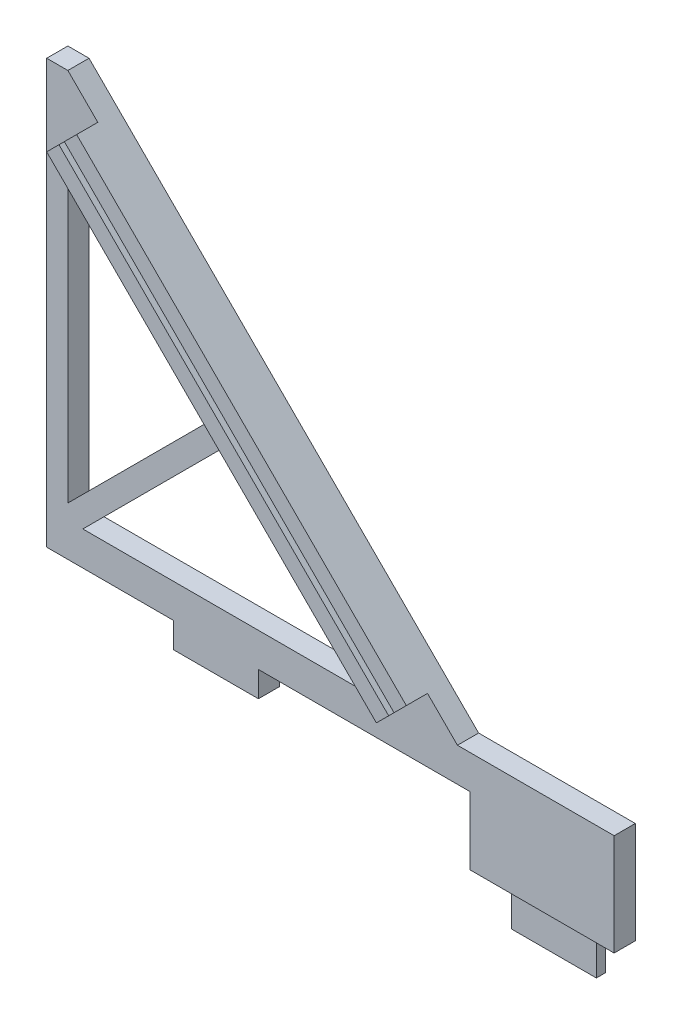
ISO-10303-21;
HEADER;
FILE_DESCRIPTION(('STEP AP214'),'2;1');
FILE_NAME('part.step','',(''),(''),'','','');
FILE_SCHEMA(('AUTOMOTIVE_DESIGN { 1 0 10303 214 1 1 1 1 }'));
ENDSEC;
DATA;
#1=APPLICATION_CONTEXT('core data for automotive mechanical design processes');
#2=APPLICATION_PROTOCOL_DEFINITION('international standard','automotive_design',2000,#1);
#3=PRODUCT_CONTEXT('',#1,'mechanical');
#4=PRODUCT('Part','Part','',(#3));
#5=PRODUCT_RELATED_PRODUCT_CATEGORY('part','',(#4));
#6=PRODUCT_DEFINITION_FORMATION('','',#4);
#7=PRODUCT_DEFINITION_CONTEXT('part definition',#1,'design');
#8=PRODUCT_DEFINITION('design','',#6,#7);
#9=PRODUCT_DEFINITION_SHAPE('','',#8);
#10=(LENGTH_UNIT() NAMED_UNIT(*) SI_UNIT(.MILLI.,.METRE.));
#11=(NAMED_UNIT(*) PLANE_ANGLE_UNIT() SI_UNIT($,.RADIAN.));
#12=(NAMED_UNIT(*) SI_UNIT($,.STERADIAN.) SOLID_ANGLE_UNIT());
#13=UNCERTAINTY_MEASURE_WITH_UNIT(LENGTH_MEASURE(1.E-05),#10,'distance_accuracy_value','');
#14=(GEOMETRIC_REPRESENTATION_CONTEXT(3) GLOBAL_UNCERTAINTY_ASSIGNED_CONTEXT((#13)) GLOBAL_UNIT_ASSIGNED_CONTEXT((#10,
#11,#12)) REPRESENTATION_CONTEXT('',''));
#15=CARTESIAN_POINT('',(0.,0.,0.));
#16=DIRECTION('',(0.,0.,1.));
#17=DIRECTION('',(1.,0.,0.));
#18=AXIS2_PLACEMENT_3D('',#15,#16,#17);
#19=CARTESIAN_POINT('',(0.,0.,3.175));
#20=DIRECTION('',(0.,0.,1.));
#21=DIRECTION('',(1.,0.,0.));
#22=AXIS2_PLACEMENT_3D('',#19,#20,#21);
#23=PLANE('',#22);
#24=DIRECTION('',(0.707106781186551,-0.707106781186544,0.));
#25=VECTOR('',#24,1.);
#26=CARTESIAN_POINT('',(-15.3302561210692,21.59,3.175));
#27=LINE('',#26,#25);
#28=CARTESIAN_POINT('',(-41.1726600756682,47.4324039545988,3.175));
#29=VERTEX_POINT('',#28);
#30=CARTESIAN_POINT('',(-38.9275960454009,45.1873399243315,3.175));
#31=VERTEX_POINT('',#30);
#32=EDGE_CURVE('E11',#29,#31,#27,.T.);
#33=ORIENTED_EDGE('',*,*,#32,.F.);
#34=DIRECTION('',(0.707106781186544,0.707106781186551,0.));
#35=VECTOR('',#34,1.);
#36=CARTESIAN_POINT('',(-41.1726600756682,47.4324039545988,3.175));
#37=LINE('',#36,#35);
#38=CARTESIAN_POINT('',(-64.77,23.8350640302668,3.175));
#39=VERTEX_POINT('',#38);
#40=EDGE_CURVE('E318',#39,#29,#37,.T.);
#41=ORIENTED_EDGE('',*,*,#40,.F.);
#42=DIRECTION('',(0.,-1.,0.));
#43=VECTOR('',#42,1.);
#44=CARTESIAN_POINT('',(-64.77,71.0297438789303,3.175));
#45=LINE('',#44,#43);
#46=CARTESIAN_POINT('',(-64.77,71.0297438789303,3.175));
#47=VERTEX_POINT('',#46);
#48=EDGE_CURVE('E315',#47,#39,#45,.T.);
#49=ORIENTED_EDGE('',*,*,#48,.F.);
#50=DIRECTION('',(-0.707106781186547,-0.707106781186547,0.));
#51=VECTOR('',#50,1.);
#52=CARTESIAN_POINT('',(-64.77,71.0297438789303,3.175));
#53=LINE('',#52,#51);
#54=CARTESIAN_POINT('',(-62.9290474951805,72.8706963837497,3.175));
#55=VERTEX_POINT('',#54);
#56=EDGE_CURVE('E260',#55,#47,#53,.T.);
#57=ORIENTED_EDGE('',*,*,#56,.F.);
#58=DIRECTION('',(-0.707106781186548,0.707106781186548,0.));
#59=VECTOR('',#58,1.);
#60=CARTESIAN_POINT('',(-62.9290474951805,72.8706963837497,3.175));
#61=LINE('',#60,#59);
#62=CARTESIAN_POINT('',(-13.48930361625,23.4309525048192,3.175));
#63=VERTEX_POINT('',#62);
#64=EDGE_CURVE('E250',#63,#55,#61,.T.);
#65=ORIENTED_EDGE('',*,*,#64,.F.);
#66=DIRECTION('',(0.707106781186547,0.707106781186548,0.));
#67=VECTOR('',#66,1.);
#68=CARTESIAN_POINT('',(-13.48930361625,23.4309525048192,3.175));
#69=LINE('',#68,#67);
#70=CARTESIAN_POINT('',(-15.3302561210692,21.59,3.175));
#71=VERTEX_POINT('',#70);
#72=EDGE_CURVE('E247',#71,#63,#69,.T.);
#73=ORIENTED_EDGE('',*,*,#72,.F.);
#74=DIRECTION('',(1.,0.,0.));
#75=VECTOR('',#74,1.);
#76=CARTESIAN_POINT('',(-62.5249359697322,21.59,3.175));
#77=LINE('',#76,#75);
#78=CARTESIAN_POINT('',(-62.5249359697322,21.59,3.175));
#79=VERTEX_POINT('',#78);
#80=EDGE_CURVE('E295',#79,#71,#77,.T.);
#81=ORIENTED_EDGE('',*,*,#80,.F.);
#82=DIRECTION('',(-0.707106781186544,-0.707106781186551,0.));
#83=VECTOR('',#82,1.);
#84=CARTESIAN_POINT('',(-38.9275960454009,45.1873399243315,3.175));
#85=LINE('',#84,#83);
#86=EDGE_CURVE('E292',#31,#79,#85,.T.);
#87=ORIENTED_EDGE('',*,*,#86,.F.);
#88=EDGE_LOOP('',(#33,#41,#49,#57,#65,#73,#81,#87));
#89=FACE_BOUND('',#88,.T.);
#90=DIRECTION('',(0.707106781186547,-0.707106781186548,0.));
#91=VECTOR('',#90,1.);
#92=CARTESIAN_POINT('',(-12.6810805653538,24.2391755557154,3.175));
#93=LINE('',#92,#91);
#94=CARTESIAN_POINT('',(-62.1208244442843,73.6789194346459,3.175));
#95=VERTEX_POINT('',#94);
#96=CARTESIAN_POINT('',(-12.6810805653538,24.2391755557154,3.175));
#97=VERTEX_POINT('',#96);
#98=EDGE_CURVE('E49',#95,#97,#93,.T.);
#99=ORIENTED_EDGE('',*,*,#98,.F.);
#100=DIRECTION('',(-0.707106781186547,-0.707106781186547,0.));
#101=VECTOR('',#100,1.);
#102=CARTESIAN_POINT('',(-62.1208244442843,73.6789194346459,3.175));
#103=LINE('',#102,#101);
#104=CARTESIAN_POINT('',(-60.2798719394651,75.5198719394651,3.175));
#105=VERTEX_POINT('',#104);
#106=EDGE_CURVE('E808',#105,#95,#103,.T.);
#107=ORIENTED_EDGE('',*,*,#106,.F.);
#108=DIRECTION('',(-0.707106781186551,0.707106781186544,0.));
#109=VECTOR('',#108,1.);
#110=CARTESIAN_POINT('',(-6.35,21.59,3.175));
#111=LINE('',#110,#109);
#112=CARTESIAN_POINT('',(-64.77,80.0099999999994,3.175));
#113=VERTEX_POINT('',#112);
#114=EDGE_CURVE('E246',#105,#113,#111,.T.);
#115=ORIENTED_EDGE('',*,*,#114,.T.);
#116=DIRECTION('',(-1.,0.,0.));
#117=VECTOR('',#116,1.);
#118=CARTESIAN_POINT('',(-64.77,80.0099999999994,3.175));
#119=LINE('',#118,#117);
#120=CARTESIAN_POINT('',(-67.945,80.0099999999994,3.175));
#121=VERTEX_POINT('',#120);
#122=EDGE_CURVE('E347',#113,#121,#119,.T.);
#123=ORIENTED_EDGE('',*,*,#122,.T.);
#124=DIRECTION('',(0.,-1.,0.));
#125=VECTOR('',#124,1.);
#126=CARTESIAN_POINT('',(-67.945,80.0099999999994,3.175));
#127=LINE('',#126,#125);
#128=CARTESIAN_POINT('',(-67.945,16.51,3.175));
#129=VERTEX_POINT('',#128);
#130=EDGE_CURVE('E349',#121,#129,#127,.T.);
#131=ORIENTED_EDGE('',*,*,#130,.T.);
#132=DIRECTION('',(1.,0.,0.));
#133=VECTOR('',#132,1.);
#134=CARTESIAN_POINT('',(-67.945,16.51,3.175));
#135=LINE('',#134,#133);
#136=CARTESIAN_POINT('',(-48.895,16.51,3.175));
#137=VERTEX_POINT('',#136);
#138=EDGE_CURVE('E351',#129,#137,#135,.T.);
#139=ORIENTED_EDGE('',*,*,#138,.T.);
#140=DIRECTION('',(0.,-1.,0.));
#141=VECTOR('',#140,1.);
#142=CARTESIAN_POINT('',(-48.895,16.51,3.175));
#143=LINE('',#142,#141);
#144=CARTESIAN_POINT('',(-48.895,12.7,3.175));
#145=VERTEX_POINT('',#144);
#146=EDGE_CURVE('E353',#137,#145,#143,.T.);
#147=ORIENTED_EDGE('',*,*,#146,.T.);
#148=DIRECTION('',(1.,0.,0.));
#149=VECTOR('',#148,1.);
#150=CARTESIAN_POINT('',(-48.895,12.7,3.175));
#151=LINE('',#150,#149);
#152=CARTESIAN_POINT('',(-36.195,12.7,3.175));
#153=VERTEX_POINT('',#152);
#154=EDGE_CURVE('E355',#145,#153,#151,.T.);
#155=ORIENTED_EDGE('',*,*,#154,.T.);
#156=DIRECTION('',(0.,1.,0.));
#157=VECTOR('',#156,1.);
#158=CARTESIAN_POINT('',(-36.195,12.7,3.175));
#159=LINE('',#158,#157);
#160=CARTESIAN_POINT('',(-36.195,16.51,3.175));
#161=VERTEX_POINT('',#160);
#162=EDGE_CURVE('E357',#153,#161,#159,.T.);
#163=ORIENTED_EDGE('',*,*,#162,.T.);
#164=DIRECTION('',(1.,0.,0.));
#165=VECTOR('',#164,1.);
#166=CARTESIAN_POINT('',(-36.195,16.51,3.175));
#167=LINE('',#166,#165);
#168=CARTESIAN_POINT('',(-4.445,16.51,3.175));
#169=VERTEX_POINT('',#168);
#170=EDGE_CURVE('E359',#161,#169,#167,.T.);
#171=ORIENTED_EDGE('',*,*,#170,.T.);
#172=DIRECTION('',(0.,-1.,0.));
#173=VECTOR('',#172,1.);
#174=CARTESIAN_POINT('',(-4.445,6.35,3.175));
#175=LINE('',#174,#173);
#176=CARTESIAN_POINT('',(-4.445,6.35,3.175));
#177=VERTEX_POINT('',#176);
#178=EDGE_CURVE('E361',#169,#177,#175,.T.);
#179=ORIENTED_EDGE('',*,*,#178,.T.);
#180=DIRECTION('',(1.,0.,0.));
#181=VECTOR('',#180,1.);
#182=CARTESIAN_POINT('',(12.7,6.35,3.175));
#183=LINE('',#182,#181);
#184=CARTESIAN_POINT('',(17.145,6.35,3.175));
#185=VERTEX_POINT('',#184);
#186=EDGE_CURVE('E338',#177,#185,#183,.T.);
#187=ORIENTED_EDGE('',*,*,#186,.T.);
#188=DIRECTION('',(0.,1.,0.));
#189=VECTOR('',#188,1.);
#190=CARTESIAN_POINT('',(17.145,6.35,3.175));
#191=LINE('',#190,#189);
#192=CARTESIAN_POINT('',(17.145,21.59,3.175));
#193=VERTEX_POINT('',#192);
#194=EDGE_CURVE('E340',#185,#193,#191,.T.);
#195=ORIENTED_EDGE('',*,*,#194,.T.);
#196=DIRECTION('',(-1.,0.,0.));
#197=VECTOR('',#196,1.);
#198=CARTESIAN_POINT('',(17.145,21.59,3.175));
#199=LINE('',#198,#197);
#200=CARTESIAN_POINT('',(-6.35,21.59,3.175));
#201=VERTEX_POINT('',#200);
#202=EDGE_CURVE('E343',#193,#201,#199,.T.);
#203=ORIENTED_EDGE('',*,*,#202,.T.);
#204=CARTESIAN_POINT('',(-10.8401280605346,26.0801280605346,3.175));
#205=VERTEX_POINT('',#204);
#206=EDGE_CURVE('E345',#201,#205,#111,.T.);
#207=ORIENTED_EDGE('',*,*,#206,.T.);
#208=DIRECTION('',(0.707106781186546,0.707106781186549,0.));
#209=VECTOR('',#208,1.);
#210=CARTESIAN_POINT('',(-10.8401280605346,26.0801280605346,3.175));
#211=LINE('',#210,#209);
#212=EDGE_CURVE('E54',#97,#205,#211,.T.);
#213=ORIENTED_EDGE('',*,*,#212,.F.);
#214=EDGE_LOOP('',(#99,#107,#115,#123,#131,#139,#147,#155,#163,#171,#179,#187,#195,#203,#207,#213));
#215=FACE_BOUND('',#214,.T.);
#216=ADVANCED_FACE('F33',(#89,#215),#23,.T.);
#217=CARTESIAN_POINT('',(0.,0.,3.175));
#218=DIRECTION('',(1.,0.,0.));
#219=DIRECTION('',(0.,0.,-1.));
#220=AXIS2_PLACEMENT_3D('',#217,#218,#219);
#221=PLANE('',#220);
#222=DIRECTION('',(0.,-1.,0.));
#223=VECTOR('',#222,1.);
#224=CARTESIAN_POINT('',(0.,0.,1.397));
#225=LINE('',#224,#223);
#226=CARTESIAN_POINT('',(0.,6.35,1.397));
#227=VERTEX_POINT('',#226);
#228=CARTESIAN_POINT('',(0.,0.,1.397));
#229=VERTEX_POINT('',#228);
#230=EDGE_CURVE('E287',#227,#229,#225,.T.);
#231=ORIENTED_EDGE('',*,*,#230,.F.);
#232=DIRECTION('',(0.,0.,-1.));
#233=VECTOR('',#232,1.);
#234=CARTESIAN_POINT('',(0.,6.35,3.175));
#235=LINE('',#234,#233);
#236=CARTESIAN_POINT('',(0.,6.35,0.));
#237=VERTEX_POINT('',#236);
#238=EDGE_CURVE('E364',#227,#237,#235,.T.);
#239=ORIENTED_EDGE('',*,*,#238,.T.);
#240=DIRECTION('',(0.,-1.,0.));
#241=VECTOR('',#240,1.);
#242=CARTESIAN_POINT('',(0.,0.,0.));
#243=LINE('',#242,#241);
#244=CARTESIAN_POINT('',(0.,0.,0.));
#245=VERTEX_POINT('',#244);
#246=EDGE_CURVE('E337',#237,#245,#243,.T.);
#247=ORIENTED_EDGE('',*,*,#246,.T.);
#248=DIRECTION('',(0.,0.,-1.));
#249=VECTOR('',#248,1.);
#250=CARTESIAN_POINT('',(0.,0.,3.175));
#251=LINE('',#250,#249);
#252=EDGE_CURVE('E37',#229,#245,#251,.T.);
#253=ORIENTED_EDGE('',*,*,#252,.F.);
#254=EDGE_LOOP('',(#231,#239,#247,#253));
#255=FACE_BOUND('',#254,.T.);
#256=ADVANCED_FACE('F35',(#255),#221,.F.);
#257=CARTESIAN_POINT('',(0.,0.,3.175));
#258=DIRECTION('',(0.,1.,0.));
#259=DIRECTION('',(0.,0.,1.));
#260=AXIS2_PLACEMENT_3D('',#257,#258,#259);
#261=PLANE('',#260);
#262=DIRECTION('',(1.,0.,0.));
#263=VECTOR('',#262,1.);
#264=CARTESIAN_POINT('',(12.7,0.,1.397));
#265=LINE('',#264,#263);
#266=CARTESIAN_POINT('',(12.7,0.,1.397));
#267=VERTEX_POINT('',#266);
#268=EDGE_CURVE('E289',#229,#267,#265,.T.);
#269=ORIENTED_EDGE('',*,*,#268,.F.);
#270=ORIENTED_EDGE('',*,*,#252,.T.);
#271=DIRECTION('',(1.,0.,0.));
#272=VECTOR('',#271,1.);
#273=CARTESIAN_POINT('',(0.,0.,0.));
#274=LINE('',#273,#272);
#275=CARTESIAN_POINT('',(12.7,0.,0.));
#276=VERTEX_POINT('',#275);
#277=EDGE_CURVE('E367',#245,#276,#274,.T.);
#278=ORIENTED_EDGE('',*,*,#277,.T.);
#279=DIRECTION('',(0.,0.,-1.));
#280=VECTOR('',#279,1.);
#281=CARTESIAN_POINT('',(12.7,0.,3.175));
#282=LINE('',#281,#280);
#283=EDGE_CURVE('E437',#267,#276,#282,.T.);
#284=ORIENTED_EDGE('',*,*,#283,.F.);
#285=EDGE_LOOP('',(#269,#270,#278,#284));
#286=FACE_BOUND('',#285,.T.);
#287=ADVANCED_FACE('F445',(#286),#261,.F.);
#288=CARTESIAN_POINT('',(12.7,0.,3.175));
#289=DIRECTION('',(-1.,0.,0.));
#290=DIRECTION('',(0.,0.,1.));
#291=AXIS2_PLACEMENT_3D('',#288,#289,#290);
#292=PLANE('',#291);
#293=DIRECTION('',(0.,1.,0.));
#294=VECTOR('',#293,1.);
#295=CARTESIAN_POINT('',(12.7,0.,1.397));
#296=LINE('',#295,#294);
#297=CARTESIAN_POINT('',(12.7,6.35,1.397));
#298=VERTEX_POINT('',#297);
#299=EDGE_CURVE('E282',#267,#298,#296,.T.);
#300=ORIENTED_EDGE('',*,*,#299,.F.);
#301=ORIENTED_EDGE('',*,*,#283,.T.);
#302=DIRECTION('',(0.,1.,0.));
#303=VECTOR('',#302,1.);
#304=CARTESIAN_POINT('',(12.7,0.,0.));
#305=LINE('',#304,#303);
#306=CARTESIAN_POINT('',(12.7,6.35,0.));
#307=VERTEX_POINT('',#306);
#308=EDGE_CURVE('E370',#276,#307,#305,.T.);
#309=ORIENTED_EDGE('',*,*,#308,.T.);
#310=DIRECTION('',(0.,0.,-1.));
#311=VECTOR('',#310,1.);
#312=CARTESIAN_POINT('',(12.7,6.35,3.175));
#313=LINE('',#312,#311);
#314=EDGE_CURVE('E436',#298,#307,#313,.T.);
#315=ORIENTED_EDGE('',*,*,#314,.F.);
#316=EDGE_LOOP('',(#300,#301,#309,#315));
#317=FACE_BOUND('',#316,.T.);
#318=ADVANCED_FACE('F512',(#317),#292,.F.);
#319=CARTESIAN_POINT('',(0.,0.,0.));
#320=DIRECTION('',(0.,0.,1.));
#321=DIRECTION('',(1.,0.,0.));
#322=AXIS2_PLACEMENT_3D('',#319,#320,#321);
#323=PLANE('',#322);
#324=DIRECTION('',(-0.707106781186551,0.707106781186544,0.));
#325=VECTOR('',#324,1.);
#326=CARTESIAN_POINT('',(-41.1726600756682,47.4324039545988,0.));
#327=LINE('',#326,#325);
#328=CARTESIAN_POINT('',(-41.1726600756682,47.4324039545988,0.));
#329=VERTEX_POINT('',#328);
#330=CARTESIAN_POINT('',(-64.77,71.0297438789303,0.));
#331=VERTEX_POINT('',#330);
#332=EDGE_CURVE('E314',#329,#331,#327,.T.);
#333=ORIENTED_EDGE('',*,*,#332,.T.);
#334=DIRECTION('',(0.,-1.,0.));
#335=VECTOR('',#334,1.);
#336=CARTESIAN_POINT('',(-64.77,71.0297438789303,0.));
#337=LINE('',#336,#335);
#338=CARTESIAN_POINT('',(-64.77,23.8350640302668,0.));
#339=VERTEX_POINT('',#338);
#340=EDGE_CURVE('E325',#331,#339,#337,.T.);
#341=ORIENTED_EDGE('',*,*,#340,.T.);
#342=DIRECTION('',(0.707106781186544,0.707106781186551,0.));
#343=VECTOR('',#342,1.);
#344=CARTESIAN_POINT('',(-41.1726600756682,47.4324039545988,0.));
#345=LINE('',#344,#343);
#346=EDGE_CURVE('E319',#339,#329,#345,.T.);
#347=ORIENTED_EDGE('',*,*,#346,.T.);
#348=EDGE_LOOP('',(#333,#341,#347));
#349=FACE_BOUND('',#348,.T.);
#350=ORIENTED_EDGE('',*,*,#246,.F.);
#351=DIRECTION('',(1.,0.,0.));
#352=VECTOR('',#351,1.);
#353=CARTESIAN_POINT('',(0.,6.35,0.));
#354=LINE('',#353,#352);
#355=CARTESIAN_POINT('',(-4.445,6.35,0.));
#356=VERTEX_POINT('',#355);
#357=EDGE_CURVE('E341',#356,#237,#354,.T.);
#358=ORIENTED_EDGE('',*,*,#357,.F.);
#359=DIRECTION('',(0.,-1.,0.));
#360=VECTOR('',#359,1.);
#361=CARTESIAN_POINT('',(-4.445,6.35,0.));
#362=LINE('',#361,#360);
#363=CARTESIAN_POINT('',(-4.445,16.51,0.));
#364=VERTEX_POINT('',#363);
#365=EDGE_CURVE('E395',#364,#356,#362,.T.);
#366=ORIENTED_EDGE('',*,*,#365,.F.);
#367=DIRECTION('',(1.,0.,0.));
#368=VECTOR('',#367,1.);
#369=CARTESIAN_POINT('',(-36.195,16.51,0.));
#370=LINE('',#369,#368);
#371=CARTESIAN_POINT('',(-36.195,16.51,0.));
#372=VERTEX_POINT('',#371);
#373=EDGE_CURVE('E393',#372,#364,#370,.T.);
#374=ORIENTED_EDGE('',*,*,#373,.F.);
#375=DIRECTION('',(0.,1.,0.));
#376=VECTOR('',#375,1.);
#377=CARTESIAN_POINT('',(-36.195,12.7,0.));
#378=LINE('',#377,#376);
#379=CARTESIAN_POINT('',(-36.195,12.7,0.));
#380=VERTEX_POINT('',#379);
#381=EDGE_CURVE('E391',#380,#372,#378,.T.);
#382=ORIENTED_EDGE('',*,*,#381,.F.);
#383=DIRECTION('',(1.,0.,0.));
#384=VECTOR('',#383,1.);
#385=CARTESIAN_POINT('',(-48.895,12.7,0.));
#386=LINE('',#385,#384);
#387=CARTESIAN_POINT('',(-48.895,12.7,0.));
#388=VERTEX_POINT('',#387);
#389=EDGE_CURVE('E389',#388,#380,#386,.T.);
#390=ORIENTED_EDGE('',*,*,#389,.F.);
#391=DIRECTION('',(0.,-1.,0.));
#392=VECTOR('',#391,1.);
#393=CARTESIAN_POINT('',(-48.895,16.51,0.));
#394=LINE('',#393,#392);
#395=CARTESIAN_POINT('',(-48.895,16.51,0.));
#396=VERTEX_POINT('',#395);
#397=EDGE_CURVE('E387',#396,#388,#394,.T.);
#398=ORIENTED_EDGE('',*,*,#397,.F.);
#399=DIRECTION('',(1.,0.,0.));
#400=VECTOR('',#399,1.);
#401=CARTESIAN_POINT('',(-67.945,16.51,0.));
#402=LINE('',#401,#400);
#403=CARTESIAN_POINT('',(-67.945,16.51,0.));
#404=VERTEX_POINT('',#403);
#405=EDGE_CURVE('E385',#404,#396,#402,.T.);
#406=ORIENTED_EDGE('',*,*,#405,.F.);
#407=DIRECTION('',(0.,-1.,0.));
#408=VECTOR('',#407,1.);
#409=CARTESIAN_POINT('',(-67.945,80.0099999999994,0.));
#410=LINE('',#409,#408);
#411=CARTESIAN_POINT('',(-67.945,80.0099999999994,0.));
#412=VERTEX_POINT('',#411);
#413=EDGE_CURVE('E383',#412,#404,#410,.T.);
#414=ORIENTED_EDGE('',*,*,#413,.F.);
#415=DIRECTION('',(-1.,0.,0.));
#416=VECTOR('',#415,1.);
#417=CARTESIAN_POINT('',(-64.77,80.0099999999994,0.));
#418=LINE('',#417,#416);
#419=CARTESIAN_POINT('',(-64.77,80.0099999999994,0.));
#420=VERTEX_POINT('',#419);
#421=EDGE_CURVE('E381',#420,#412,#418,.T.);
#422=ORIENTED_EDGE('',*,*,#421,.F.);
#423=DIRECTION('',(-0.707106781186551,0.707106781186544,0.));
#424=VECTOR('',#423,1.);
#425=CARTESIAN_POINT('',(-6.35,21.59,0.));
#426=LINE('',#425,#424);
#427=CARTESIAN_POINT('',(-6.35,21.59,0.));
#428=VERTEX_POINT('',#427);
#429=EDGE_CURVE('E379',#428,#420,#426,.T.);
#430=ORIENTED_EDGE('',*,*,#429,.F.);
#431=DIRECTION('',(-1.,0.,0.));
#432=VECTOR('',#431,1.);
#433=CARTESIAN_POINT('',(17.145,21.59,0.));
#434=LINE('',#433,#432);
#435=CARTESIAN_POINT('',(17.145,21.59,0.));
#436=VERTEX_POINT('',#435);
#437=EDGE_CURVE('E377',#436,#428,#434,.T.);
#438=ORIENTED_EDGE('',*,*,#437,.F.);
#439=DIRECTION('',(0.,1.,0.));
#440=VECTOR('',#439,1.);
#441=CARTESIAN_POINT('',(17.145,6.35,0.));
#442=LINE('',#441,#440);
#443=CARTESIAN_POINT('',(17.145,6.35,0.));
#444=VERTEX_POINT('',#443);
#445=EDGE_CURVE('E375',#444,#436,#442,.T.);
#446=ORIENTED_EDGE('',*,*,#445,.F.);
#447=DIRECTION('',(1.,0.,0.));
#448=VECTOR('',#447,1.);
#449=CARTESIAN_POINT('',(12.7,6.35,0.));
#450=LINE('',#449,#448);
#451=EDGE_CURVE('E373',#307,#444,#450,.T.);
#452=ORIENTED_EDGE('',*,*,#451,.F.);
#453=ORIENTED_EDGE('',*,*,#308,.F.);
#454=ORIENTED_EDGE('',*,*,#277,.F.);
#455=EDGE_LOOP('',(#350,#358,#366,#374,#382,#390,#398,#406,#414,#422,#430,#438,#446,#452,#453,#454));
#456=FACE_BOUND('',#455,.T.);
#457=DIRECTION('',(-0.707106781186551,0.707106781186544,0.));
#458=VECTOR('',#457,1.);
#459=CARTESIAN_POINT('',(-15.3302561210692,21.59,0.));
#460=LINE('',#459,#458);
#461=CARTESIAN_POINT('',(-15.3302561210692,21.59,0.));
#462=VERTEX_POINT('',#461);
#463=CARTESIAN_POINT('',(-38.9275960454009,45.1873399243315,0.));
#464=VERTEX_POINT('',#463);
#465=EDGE_CURVE('E291',#462,#464,#460,.T.);
#466=ORIENTED_EDGE('',*,*,#465,.T.);
#467=DIRECTION('',(-0.707106781186544,-0.707106781186551,0.));
#468=VECTOR('',#467,1.);
#469=CARTESIAN_POINT('',(-38.9275960454009,45.1873399243315,0.));
#470=LINE('',#469,#468);
#471=CARTESIAN_POINT('',(-62.5249359697322,21.59,0.));
#472=VERTEX_POINT('',#471);
#473=EDGE_CURVE('E302',#464,#472,#470,.T.);
#474=ORIENTED_EDGE('',*,*,#473,.T.);
#475=DIRECTION('',(1.,0.,0.));
#476=VECTOR('',#475,1.);
#477=CARTESIAN_POINT('',(-62.5249359697322,21.59,0.));
#478=LINE('',#477,#476);
#479=EDGE_CURVE('E296',#472,#462,#478,.T.);
#480=ORIENTED_EDGE('',*,*,#479,.T.);
#481=EDGE_LOOP('',(#466,#474,#480));
#482=FACE_BOUND('',#481,.T.);
#483=ADVANCED_FACE('F451',(#349,#456,#482),#323,.F.);
#484=CARTESIAN_POINT('',(17.145,6.35,3.175));
#485=DIRECTION('',(-1.,0.,0.));
#486=DIRECTION('',(0.,-1.,0.));
#487=AXIS2_PLACEMENT_3D('',#484,#485,#486);
#488=PLANE('',#487);
#489=ORIENTED_EDGE('',*,*,#445,.T.);
#490=DIRECTION('',(0.,0.,-1.));
#491=VECTOR('',#490,1.);
#492=CARTESIAN_POINT('',(17.145,21.59,3.175));
#493=LINE('',#492,#491);
#494=EDGE_CURVE('E430',#193,#436,#493,.T.);
#495=ORIENTED_EDGE('',*,*,#494,.F.);
#496=ORIENTED_EDGE('',*,*,#194,.F.);
#497=DIRECTION('',(0.,0.,-1.));
#498=VECTOR('',#497,1.);
#499=CARTESIAN_POINT('',(17.145,6.35,3.175));
#500=LINE('',#499,#498);
#501=EDGE_CURVE('E433',#185,#444,#500,.T.);
#502=ORIENTED_EDGE('',*,*,#501,.T.);
#503=EDGE_LOOP('',(#489,#495,#496,#502));
#504=FACE_BOUND('',#503,.T.);
#505=ADVANCED_FACE('F509',(#504),#488,.F.);
#506=CARTESIAN_POINT('',(17.145,21.59,3.175));
#507=DIRECTION('',(0.,-1.,0.));
#508=DIRECTION('',(1.,0.,0.));
#509=AXIS2_PLACEMENT_3D('',#506,#507,#508);
#510=PLANE('',#509);
#511=ORIENTED_EDGE('',*,*,#437,.T.);
#512=DIRECTION('',(0.,0.,-1.));
#513=VECTOR('',#512,1.);
#514=CARTESIAN_POINT('',(-6.35,21.59,3.175));
#515=LINE('',#514,#513);
#516=EDGE_CURVE('E427',#201,#428,#515,.T.);
#517=ORIENTED_EDGE('',*,*,#516,.F.);
#518=ORIENTED_EDGE('',*,*,#202,.F.);
#519=ORIENTED_EDGE('',*,*,#494,.T.);
#520=EDGE_LOOP('',(#511,#517,#518,#519));
#521=FACE_BOUND('',#520,.T.);
#522=ADVANCED_FACE('F504',(#521),#510,.F.);
#523=CARTESIAN_POINT('',(-6.35,21.59,3.175));
#524=DIRECTION('',(-0.707106781186544,-0.707106781186551,0.));
#525=DIRECTION('',(0.707106781186551,-0.707106781186544,0.));
#526=AXIS2_PLACEMENT_3D('',#523,#524,#525);
#527=PLANE('',#526);
#528=ORIENTED_EDGE('',*,*,#429,.T.);
#529=DIRECTION('',(0.,0.,-1.));
#530=VECTOR('',#529,1.);
#531=CARTESIAN_POINT('',(-64.77,80.0099999999994,3.175));
#532=LINE('',#531,#530);
#533=EDGE_CURVE('E424',#113,#420,#532,.T.);
#534=ORIENTED_EDGE('',*,*,#533,.F.);
#535=ORIENTED_EDGE('',*,*,#114,.F.);
#536=DIRECTION('',(0.,0.,-1.));
#537=VECTOR('',#536,1.);
#538=CARTESIAN_POINT('',(-60.2798719394651,75.5198719394651,6.35));
#539=LINE('',#538,#537);
#540=CARTESIAN_POINT('',(-60.2798719394651,75.5198719394651,6.35));
#541=VERTEX_POINT('',#540);
#542=EDGE_CURVE('E228',#541,#105,#539,.T.);
#543=ORIENTED_EDGE('',*,*,#542,.F.);
#544=DIRECTION('',(-0.707106781186548,0.707106781186548,0.));
#545=VECTOR('',#544,1.);
#546=CARTESIAN_POINT('',(-60.2798719394651,75.5198719394651,6.35));
#547=LINE('',#546,#545);
#548=CARTESIAN_POINT('',(-10.8401280605346,26.0801280605346,6.35));
#549=VERTEX_POINT('',#548);
#550=EDGE_CURVE('E234',#549,#541,#547,.T.);
#551=ORIENTED_EDGE('',*,*,#550,.F.);
#552=DIRECTION('',(0.,0.,-1.));
#553=VECTOR('',#552,1.);
#554=CARTESIAN_POINT('',(-10.8401280605346,26.0801280605346,6.35));
#555=LINE('',#554,#553);
#556=EDGE_CURVE('E801',#549,#205,#555,.T.);
#557=ORIENTED_EDGE('',*,*,#556,.T.);
#558=ORIENTED_EDGE('',*,*,#206,.F.);
#559=ORIENTED_EDGE('',*,*,#516,.T.);
#560=EDGE_LOOP('',(#528,#534,#535,#543,#551,#557,#558,#559));
#561=FACE_BOUND('',#560,.T.);
#562=ADVANCED_FACE('F244',(#561),#527,.F.);
#563=CARTESIAN_POINT('',(-64.77,80.0099999999994,3.175));
#564=DIRECTION('',(0.,-1.,0.));
#565=DIRECTION('',(1.,0.,0.));
#566=AXIS2_PLACEMENT_3D('',#563,#564,#565);
#567=PLANE('',#566);
#568=ORIENTED_EDGE('',*,*,#421,.T.);
#569=DIRECTION('',(0.,0.,-1.));
#570=VECTOR('',#569,1.);
#571=CARTESIAN_POINT('',(-67.945,80.0099999999994,3.175));
#572=LINE('',#571,#570);
#573=EDGE_CURVE('E421',#121,#412,#572,.T.);
#574=ORIENTED_EDGE('',*,*,#573,.F.);
#575=ORIENTED_EDGE('',*,*,#122,.F.);
#576=ORIENTED_EDGE('',*,*,#533,.T.);
#577=EDGE_LOOP('',(#568,#574,#575,#576));
#578=FACE_BOUND('',#577,.T.);
#579=ADVANCED_FACE('F498',(#578),#567,.F.);
#580=CARTESIAN_POINT('',(-67.945,80.0099999999994,3.175));
#581=DIRECTION('',(1.,0.,0.));
#582=DIRECTION('',(0.,0.,-1.));
#583=AXIS2_PLACEMENT_3D('',#580,#581,#582);
#584=PLANE('',#583);
#585=ORIENTED_EDGE('',*,*,#413,.T.);
#586=DIRECTION('',(0.,0.,-1.));
#587=VECTOR('',#586,1.);
#588=CARTESIAN_POINT('',(-67.945,16.51,3.175));
#589=LINE('',#588,#587);
#590=EDGE_CURVE('E418',#129,#404,#589,.T.);
#591=ORIENTED_EDGE('',*,*,#590,.F.);
#592=ORIENTED_EDGE('',*,*,#130,.F.);
#593=ORIENTED_EDGE('',*,*,#573,.T.);
#594=EDGE_LOOP('',(#585,#591,#592,#593));
#595=FACE_BOUND('',#594,.T.);
#596=ADVANCED_FACE('F493',(#595),#584,.F.);
#597=CARTESIAN_POINT('',(-67.945,16.51,3.175));
#598=DIRECTION('',(0.,1.,0.));
#599=DIRECTION('',(0.,0.,1.));
#600=AXIS2_PLACEMENT_3D('',#597,#598,#599);
#601=PLANE('',#600);
#602=ORIENTED_EDGE('',*,*,#405,.T.);
#603=DIRECTION('',(0.,0.,-1.));
#604=VECTOR('',#603,1.);
#605=CARTESIAN_POINT('',(-48.895,16.51,3.175));
#606=LINE('',#605,#604);
#607=EDGE_CURVE('E415',#137,#396,#606,.T.);
#608=ORIENTED_EDGE('',*,*,#607,.F.);
#609=ORIENTED_EDGE('',*,*,#138,.F.);
#610=ORIENTED_EDGE('',*,*,#590,.T.);
#611=EDGE_LOOP('',(#602,#608,#609,#610));
#612=FACE_BOUND('',#611,.T.);
#613=ADVANCED_FACE('F487',(#612),#601,.F.);
#614=CARTESIAN_POINT('',(-48.895,16.51,3.175));
#615=DIRECTION('',(1.,0.,0.));
#616=DIRECTION('',(0.,0.,-1.));
#617=AXIS2_PLACEMENT_3D('',#614,#615,#616);
#618=PLANE('',#617);
#619=ORIENTED_EDGE('',*,*,#397,.T.);
#620=DIRECTION('',(0.,0.,-1.));
#621=VECTOR('',#620,1.);
#622=CARTESIAN_POINT('',(-48.895,12.7,3.175));
#623=LINE('',#622,#621);
#624=EDGE_CURVE('E412',#145,#388,#623,.T.);
#625=ORIENTED_EDGE('',*,*,#624,.F.);
#626=ORIENTED_EDGE('',*,*,#146,.F.);
#627=ORIENTED_EDGE('',*,*,#607,.T.);
#628=EDGE_LOOP('',(#619,#625,#626,#627));
#629=FACE_BOUND('',#628,.T.);
#630=ADVANCED_FACE('F483',(#629),#618,.F.);
#631=CARTESIAN_POINT('',(-48.895,12.7,3.175));
#632=DIRECTION('',(0.,1.,0.));
#633=DIRECTION('',(0.,0.,1.));
#634=AXIS2_PLACEMENT_3D('',#631,#632,#633);
#635=PLANE('',#634);
#636=ORIENTED_EDGE('',*,*,#389,.T.);
#637=DIRECTION('',(0.,0.,-1.));
#638=VECTOR('',#637,1.);
#639=CARTESIAN_POINT('',(-36.195,12.7,3.175));
#640=LINE('',#639,#638);
#641=EDGE_CURVE('E409',#153,#380,#640,.T.);
#642=ORIENTED_EDGE('',*,*,#641,.F.);
#643=ORIENTED_EDGE('',*,*,#154,.F.);
#644=ORIENTED_EDGE('',*,*,#624,.T.);
#645=EDGE_LOOP('',(#636,#642,#643,#644));
#646=FACE_BOUND('',#645,.T.);
#647=ADVANCED_FACE('F478',(#646),#635,.F.);
#648=CARTESIAN_POINT('',(-36.195,12.7,3.175));
#649=DIRECTION('',(-1.,0.,0.));
#650=DIRECTION('',(0.,0.,1.));
#651=AXIS2_PLACEMENT_3D('',#648,#649,#650);
#652=PLANE('',#651);
#653=ORIENTED_EDGE('',*,*,#381,.T.);
#654=DIRECTION('',(0.,0.,-1.));
#655=VECTOR('',#654,1.);
#656=CARTESIAN_POINT('',(-36.195,16.51,3.175));
#657=LINE('',#656,#655);
#658=EDGE_CURVE('E406',#161,#372,#657,.T.);
#659=ORIENTED_EDGE('',*,*,#658,.F.);
#660=ORIENTED_EDGE('',*,*,#162,.F.);
#661=ORIENTED_EDGE('',*,*,#641,.T.);
#662=EDGE_LOOP('',(#653,#659,#660,#661));
#663=FACE_BOUND('',#662,.T.);
#664=ADVANCED_FACE('F472',(#663),#652,.F.);
#665=CARTESIAN_POINT('',(-36.195,16.51,3.175));
#666=DIRECTION('',(0.,1.,0.));
#667=DIRECTION('',(0.,0.,1.));
#668=AXIS2_PLACEMENT_3D('',#665,#666,#667);
#669=PLANE('',#668);
#670=ORIENTED_EDGE('',*,*,#373,.T.);
#671=DIRECTION('',(0.,0.,-1.));
#672=VECTOR('',#671,1.);
#673=CARTESIAN_POINT('',(-4.445,16.51,3.175));
#674=LINE('',#673,#672);
#675=EDGE_CURVE('E403',#169,#364,#674,.T.);
#676=ORIENTED_EDGE('',*,*,#675,.F.);
#677=ORIENTED_EDGE('',*,*,#170,.F.);
#678=ORIENTED_EDGE('',*,*,#658,.T.);
#679=EDGE_LOOP('',(#670,#676,#677,#678));
#680=FACE_BOUND('',#679,.T.);
#681=ADVANCED_FACE('F468',(#680),#669,.F.);
#682=CARTESIAN_POINT('',(-4.445,6.35,3.175));
#683=DIRECTION('',(1.,0.,0.));
#684=DIRECTION('',(0.,1.,0.));
#685=AXIS2_PLACEMENT_3D('',#682,#683,#684);
#686=PLANE('',#685);
#687=ORIENTED_EDGE('',*,*,#365,.T.);
#688=DIRECTION('',(0.,0.,-1.));
#689=VECTOR('',#688,1.);
#690=CARTESIAN_POINT('',(-4.445,6.35,3.175));
#691=LINE('',#690,#689);
#692=EDGE_CURVE('E400',#177,#356,#691,.T.);
#693=ORIENTED_EDGE('',*,*,#692,.F.);
#694=ORIENTED_EDGE('',*,*,#178,.F.);
#695=ORIENTED_EDGE('',*,*,#675,.T.);
#696=EDGE_LOOP('',(#687,#693,#694,#695));
#697=FACE_BOUND('',#696,.T.);
#698=ADVANCED_FACE('F463',(#697),#686,.F.);
#699=CARTESIAN_POINT('',(0.,6.35,3.175));
#700=DIRECTION('',(0.,1.,0.));
#701=DIRECTION('',(0.,0.,1.));
#702=AXIS2_PLACEMENT_3D('',#699,#700,#701);
#703=PLANE('',#702);
#704=ORIENTED_EDGE('',*,*,#357,.T.);
#705=ORIENTED_EDGE('',*,*,#238,.F.);
#706=DIRECTION('',(-1.,0.,0.));
#707=VECTOR('',#706,1.);
#708=CARTESIAN_POINT('',(12.7,6.35,1.397));
#709=LINE('',#708,#707);
#710=EDGE_CURVE('E285',#298,#227,#709,.T.);
#711=ORIENTED_EDGE('',*,*,#710,.F.);
#712=ORIENTED_EDGE('',*,*,#314,.T.);
#713=ORIENTED_EDGE('',*,*,#451,.T.);
#714=ORIENTED_EDGE('',*,*,#501,.F.);
#715=ORIENTED_EDGE('',*,*,#186,.F.);
#716=ORIENTED_EDGE('',*,*,#692,.T.);
#717=EDGE_LOOP('',(#704,#705,#711,#712,#713,#714,#715,#716));
#718=FACE_BOUND('',#717,.T.);
#719=ADVANCED_FACE('F457',(#718),#703,.F.);
#720=CARTESIAN_POINT('',(-41.1726600756682,47.4324039545988,3.175));
#721=DIRECTION('',(-0.707106781186544,-0.707106781186551,0.));
#722=DIRECTION('',(0.707106781186551,-0.707106781186544,0.));
#723=AXIS2_PLACEMENT_3D('',#720,#721,#722);
#724=PLANE('',#723);
#725=ORIENTED_EDGE('',*,*,#332,.F.);
#726=DIRECTION('',(0.,0.,-1.));
#727=VECTOR('',#726,1.);
#728=CARTESIAN_POINT('',(-41.1726600756682,47.4324039545988,3.175));
#729=LINE('',#728,#727);
#730=EDGE_CURVE('E322',#29,#329,#729,.T.);
#731=ORIENTED_EDGE('',*,*,#730,.F.);
#732=ORIENTED_EDGE('',*,*,#32,.T.);
#733=DIRECTION('',(0.,0.,-1.));
#734=VECTOR('',#733,1.);
#735=CARTESIAN_POINT('',(-38.9275960454009,45.1873399243315,3.175));
#736=LINE('',#735,#734);
#737=EDGE_CURVE('E311',#31,#464,#736,.T.);
#738=ORIENTED_EDGE('',*,*,#737,.T.);
#739=ORIENTED_EDGE('',*,*,#465,.F.);
#740=DIRECTION('',(0.,0.,-1.));
#741=VECTOR('',#740,1.);
#742=CARTESIAN_POINT('',(-15.3302561210692,21.59,3.175));
#743=LINE('',#742,#741);
#744=EDGE_CURVE('E299',#71,#462,#743,.T.);
#745=ORIENTED_EDGE('',*,*,#744,.F.);
#746=DIRECTION('',(0.,0.,-1.));
#747=VECTOR('',#746,1.);
#748=CARTESIAN_POINT('',(-15.3302561210692,21.59,6.35));
#749=LINE('',#748,#747);
#750=CARTESIAN_POINT('',(-15.3302561210692,21.59,6.35));
#751=VERTEX_POINT('',#750);
#752=EDGE_CURVE('E265',#751,#71,#749,.T.);
#753=ORIENTED_EDGE('',*,*,#752,.F.);
#754=DIRECTION('',(0.707106781186551,-0.707106781186544,0.));
#755=VECTOR('',#754,1.);
#756=CARTESIAN_POINT('',(-15.3302561210692,21.59,6.35));
#757=LINE('',#756,#755);
#758=CARTESIAN_POINT('',(-64.77,71.0297438789303,6.35));
#759=VERTEX_POINT('',#758);
#760=EDGE_CURVE('E264',#759,#751,#757,.T.);
#761=ORIENTED_EDGE('',*,*,#760,.F.);
#762=DIRECTION('',(0.,0.,-1.));
#763=VECTOR('',#762,1.);
#764=CARTESIAN_POINT('',(-64.77,71.0297438789303,6.35));
#765=LINE('',#764,#763);
#766=EDGE_CURVE('E273',#759,#47,#765,.T.);
#767=ORIENTED_EDGE('',*,*,#766,.T.);
#768=DIRECTION('',(0.,0.,-1.));
#769=VECTOR('',#768,1.);
#770=CARTESIAN_POINT('',(-64.77,71.0297438789303,3.175));
#771=LINE('',#770,#769);
#772=EDGE_CURVE('E334',#47,#331,#771,.T.);
#773=ORIENTED_EDGE('',*,*,#772,.T.);
#774=EDGE_LOOP('',(#725,#731,#732,#738,#739,#745,#753,#761,#767,#773));
#775=FACE_BOUND('',#774,.T.);
#776=ADVANCED_FACE('F529',(#775),#724,.T.);
#777=CARTESIAN_POINT('',(-64.77,71.0297438789303,3.175));
#778=DIRECTION('',(1.,0.,0.));
#779=DIRECTION('',(0.,1.,0.));
#780=AXIS2_PLACEMENT_3D('',#777,#778,#779);
#781=PLANE('',#780);
#782=ORIENTED_EDGE('',*,*,#340,.F.);
#783=ORIENTED_EDGE('',*,*,#772,.F.);
#784=ORIENTED_EDGE('',*,*,#48,.T.);
#785=DIRECTION('',(0.,0.,-1.));
#786=VECTOR('',#785,1.);
#787=CARTESIAN_POINT('',(-64.77,23.8350640302668,3.175));
#788=LINE('',#787,#786);
#789=EDGE_CURVE('E332',#39,#339,#788,.T.);
#790=ORIENTED_EDGE('',*,*,#789,.T.);
#791=EDGE_LOOP('',(#782,#783,#784,#790));
#792=FACE_BOUND('',#791,.T.);
#793=ADVANCED_FACE('F610',(#792),#781,.T.);
#794=CARTESIAN_POINT('',(-41.1726600756682,47.4324039545988,3.175));
#795=DIRECTION('',(-0.707106781186551,0.707106781186544,0.));
#796=DIRECTION('',(-0.707106781186544,-0.707106781186551,0.));
#797=AXIS2_PLACEMENT_3D('',#794,#795,#796);
#798=PLANE('',#797);
#799=ORIENTED_EDGE('',*,*,#346,.F.);
#800=ORIENTED_EDGE('',*,*,#789,.F.);
#801=ORIENTED_EDGE('',*,*,#40,.T.);
#802=ORIENTED_EDGE('',*,*,#730,.T.);
#803=EDGE_LOOP('',(#799,#800,#801,#802));
#804=FACE_BOUND('',#803,.T.);
#805=ADVANCED_FACE('F617',(#804),#798,.T.);
#806=CARTESIAN_POINT('',(-38.9275960454009,45.1873399243315,3.175));
#807=DIRECTION('',(0.707106781186551,-0.707106781186544,0.));
#808=DIRECTION('',(0.707106781186544,0.707106781186551,0.));
#809=AXIS2_PLACEMENT_3D('',#806,#807,#808);
#810=PLANE('',#809);
#811=ORIENTED_EDGE('',*,*,#473,.F.);
#812=ORIENTED_EDGE('',*,*,#737,.F.);
#813=ORIENTED_EDGE('',*,*,#86,.T.);
#814=DIRECTION('',(0.,0.,-1.));
#815=VECTOR('',#814,1.);
#816=CARTESIAN_POINT('',(-62.5249359697322,21.59,3.175));
#817=LINE('',#816,#815);
#818=EDGE_CURVE('E309',#79,#472,#817,.T.);
#819=ORIENTED_EDGE('',*,*,#818,.T.);
#820=EDGE_LOOP('',(#811,#812,#813,#819));
#821=FACE_BOUND('',#820,.T.);
#822=ADVANCED_FACE('F624',(#821),#810,.T.);
#823=CARTESIAN_POINT('',(-62.5249359697322,21.59,3.175));
#824=DIRECTION('',(0.,1.,0.));
#825=DIRECTION('',(-1.,0.,0.));
#826=AXIS2_PLACEMENT_3D('',#823,#824,#825);
#827=PLANE('',#826);
#828=ORIENTED_EDGE('',*,*,#479,.F.);
#829=ORIENTED_EDGE('',*,*,#818,.F.);
#830=ORIENTED_EDGE('',*,*,#80,.T.);
#831=ORIENTED_EDGE('',*,*,#744,.T.);
#832=EDGE_LOOP('',(#828,#829,#830,#831));
#833=FACE_BOUND('',#832,.T.);
#834=ADVANCED_FACE('F632',(#833),#827,.T.);
#835=CARTESIAN_POINT('',(0.,0.,1.397));
#836=DIRECTION('',(0.,0.,1.));
#837=DIRECTION('',(1.,0.,0.));
#838=AXIS2_PLACEMENT_3D('',#835,#836,#837);
#839=PLANE('',#838);
#840=ORIENTED_EDGE('',*,*,#299,.T.);
#841=ORIENTED_EDGE('',*,*,#710,.T.);
#842=ORIENTED_EDGE('',*,*,#230,.T.);
#843=ORIENTED_EDGE('',*,*,#268,.T.);
#844=EDGE_LOOP('',(#840,#841,#842,#843));
#845=FACE_BOUND('',#844,.T.);
#846=ADVANCED_FACE('F640',(#845),#839,.T.);
#847=CARTESIAN_POINT('',(-13.48930361625,23.4309525048192,6.35));
#848=DIRECTION('',(-0.707106781186548,0.707106781186547,0.));
#849=DIRECTION('',(-0.707106781186547,-0.707106781186548,0.));
#850=AXIS2_PLACEMENT_3D('',#847,#848,#849);
#851=PLANE('',#850);
#852=ORIENTED_EDGE('',*,*,#72,.T.);
#853=DIRECTION('',(0.,0.,-1.));
#854=VECTOR('',#853,1.);
#855=CARTESIAN_POINT('',(-13.48930361625,23.4309525048192,6.35));
#856=LINE('',#855,#854);
#857=CARTESIAN_POINT('',(-13.48930361625,23.4309525048192,6.35));
#858=VERTEX_POINT('',#857);
#859=EDGE_CURVE('E279',#858,#63,#856,.T.);
#860=ORIENTED_EDGE('',*,*,#859,.F.);
#861=DIRECTION('',(0.707106781186547,0.707106781186548,0.));
#862=VECTOR('',#861,1.);
#863=CARTESIAN_POINT('',(-13.48930361625,23.4309525048192,6.35));
#864=LINE('',#863,#862);
#865=EDGE_CURVE('E256',#751,#858,#864,.T.);
#866=ORIENTED_EDGE('',*,*,#865,.F.);
#867=ORIENTED_EDGE('',*,*,#752,.T.);
#868=EDGE_LOOP('',(#852,#860,#866,#867));
#869=FACE_BOUND('',#868,.T.);
#870=ADVANCED_FACE('F648',(#869),#851,.F.);
#871=CARTESIAN_POINT('',(-62.9290474951805,72.8706963837497,6.35));
#872=DIRECTION('',(-0.707106781186548,-0.707106781186548,0.));
#873=DIRECTION('',(0.707106781186548,-0.707106781186548,0.));
#874=AXIS2_PLACEMENT_3D('',#871,#872,#873);
#875=PLANE('',#874);
#876=ORIENTED_EDGE('',*,*,#64,.T.);
#877=DIRECTION('',(0.,0.,-1.));
#878=VECTOR('',#877,1.);
#879=CARTESIAN_POINT('',(-62.9290474951805,72.8706963837497,6.35));
#880=LINE('',#879,#878);
#881=CARTESIAN_POINT('',(-62.9290474951805,72.8706963837497,6.35));
#882=VERTEX_POINT('',#881);
#883=EDGE_CURVE('E276',#882,#55,#880,.T.);
#884=ORIENTED_EDGE('',*,*,#883,.F.);
#885=DIRECTION('',(-0.707106781186548,0.707106781186548,0.));
#886=VECTOR('',#885,1.);
#887=CARTESIAN_POINT('',(-62.9290474951805,72.8706963837497,6.35));
#888=LINE('',#887,#886);
#889=EDGE_CURVE('E259',#858,#882,#888,.T.);
#890=ORIENTED_EDGE('',*,*,#889,.F.);
#891=ORIENTED_EDGE('',*,*,#859,.T.);
#892=EDGE_LOOP('',(#876,#884,#890,#891));
#893=FACE_BOUND('',#892,.T.);
#894=ADVANCED_FACE('F655',(#893),#875,.F.);
#895=CARTESIAN_POINT('',(-64.77,71.0297438789303,6.35));
#896=DIRECTION('',(0.707106781186548,-0.707106781186548,0.));
#897=DIRECTION('',(0.707106781186548,0.707106781186548,0.));
#898=AXIS2_PLACEMENT_3D('',#895,#896,#897);
#899=PLANE('',#898);
#900=ORIENTED_EDGE('',*,*,#56,.T.);
#901=ORIENTED_EDGE('',*,*,#766,.F.);
#902=DIRECTION('',(-0.707106781186547,-0.707106781186547,0.));
#903=VECTOR('',#902,1.);
#904=CARTESIAN_POINT('',(-64.77,71.0297438789303,6.35));
#905=LINE('',#904,#903);
#906=EDGE_CURVE('E262',#882,#759,#905,.T.);
#907=ORIENTED_EDGE('',*,*,#906,.F.);
#908=ORIENTED_EDGE('',*,*,#883,.T.);
#909=EDGE_LOOP('',(#900,#901,#907,#908));
#910=FACE_BOUND('',#909,.T.);
#911=ADVANCED_FACE('F663',(#910),#899,.F.);
#912=CARTESIAN_POINT('',(0.,0.,6.35));
#913=DIRECTION('',(0.,0.,-1.));
#914=DIRECTION('',(-1.,0.,0.));
#915=AXIS2_PLACEMENT_3D('',#912,#913,#914);
#916=PLANE('',#915);
#917=ORIENTED_EDGE('',*,*,#865,.T.);
#918=ORIENTED_EDGE('',*,*,#889,.T.);
#919=ORIENTED_EDGE('',*,*,#906,.T.);
#920=ORIENTED_EDGE('',*,*,#760,.T.);
#921=EDGE_LOOP('',(#917,#918,#919,#920));
#922=FACE_BOUND('',#921,.T.);
#923=ADVANCED_FACE('F671',(#922),#916,.F.);
#924=CARTESIAN_POINT('',(-62.1208244442843,73.6789194346459,6.35));
#925=DIRECTION('',(0.707106781186548,-0.707106781186548,0.));
#926=DIRECTION('',(0.707106781186548,0.707106781186548,0.));
#927=AXIS2_PLACEMENT_3D('',#924,#925,#926);
#928=PLANE('',#927);
#929=ORIENTED_EDGE('',*,*,#106,.T.);
#930=DIRECTION('',(0.,0.,-1.));
#931=VECTOR('',#930,1.);
#932=CARTESIAN_POINT('',(-62.1208244442843,73.6789194346459,6.35));
#933=LINE('',#932,#931);
#934=CARTESIAN_POINT('',(-62.1208244442843,73.6789194346459,6.35));
#935=VERTEX_POINT('',#934);
#936=EDGE_CURVE('E230',#935,#95,#933,.T.);
#937=ORIENTED_EDGE('',*,*,#936,.F.);
#938=DIRECTION('',(-0.707106781186547,-0.707106781186547,0.));
#939=VECTOR('',#938,1.);
#940=CARTESIAN_POINT('',(-62.1208244442843,73.6789194346459,6.35));
#941=LINE('',#940,#939);
#942=EDGE_CURVE('E224',#541,#935,#941,.T.);
#943=ORIENTED_EDGE('',*,*,#942,.F.);
#944=ORIENTED_EDGE('',*,*,#542,.T.);
#945=EDGE_LOOP('',(#929,#937,#943,#944));
#946=FACE_BOUND('',#945,.T.);
#947=ADVANCED_FACE('F226',(#946),#928,.F.);
#948=CARTESIAN_POINT('',(-12.6810805653538,24.2391755557154,6.35));
#949=DIRECTION('',(0.707106781186548,0.707106781186547,0.));
#950=DIRECTION('',(-0.707106781186547,0.707106781186548,0.));
#951=AXIS2_PLACEMENT_3D('',#948,#949,#950);
#952=PLANE('',#951);
#953=ORIENTED_EDGE('',*,*,#98,.T.);
#954=DIRECTION('',(0.,0.,-1.));
#955=VECTOR('',#954,1.);
#956=CARTESIAN_POINT('',(-12.6810805653538,24.2391755557154,6.35));
#957=LINE('',#956,#955);
#958=CARTESIAN_POINT('',(-12.6810805653538,24.2391755557154,6.35));
#959=VERTEX_POINT('',#958);
#960=EDGE_CURVE('E252',#959,#97,#957,.T.);
#961=ORIENTED_EDGE('',*,*,#960,.F.);
#962=DIRECTION('',(0.707106781186547,-0.707106781186548,0.));
#963=VECTOR('',#962,1.);
#964=CARTESIAN_POINT('',(-12.6810805653538,24.2391755557154,6.35));
#965=LINE('',#964,#963);
#966=EDGE_CURVE('E233',#935,#959,#965,.T.);
#967=ORIENTED_EDGE('',*,*,#966,.F.);
#968=ORIENTED_EDGE('',*,*,#936,.T.);
#969=EDGE_LOOP('',(#953,#961,#967,#968));
#970=FACE_BOUND('',#969,.T.);
#971=ADVANCED_FACE('F686',(#970),#952,.F.);
#972=CARTESIAN_POINT('',(-10.8401280605346,26.0801280605346,6.35));
#973=DIRECTION('',(-0.707106781186549,0.707106781186546,0.));
#974=DIRECTION('',(-0.707106781186546,-0.707106781186549,0.));
#975=AXIS2_PLACEMENT_3D('',#972,#973,#974);
#976=PLANE('',#975);
#977=ORIENTED_EDGE('',*,*,#212,.T.);
#978=ORIENTED_EDGE('',*,*,#556,.F.);
#979=DIRECTION('',(0.707106781186546,0.707106781186549,0.));
#980=VECTOR('',#979,1.);
#981=CARTESIAN_POINT('',(-10.8401280605346,26.0801280605346,6.35));
#982=LINE('',#981,#980);
#983=EDGE_CURVE('E239',#959,#549,#982,.T.);
#984=ORIENTED_EDGE('',*,*,#983,.F.);
#985=ORIENTED_EDGE('',*,*,#960,.T.);
#986=EDGE_LOOP('',(#977,#978,#984,#985));
#987=FACE_BOUND('',#986,.T.);
#988=ADVANCED_FACE('F693',(#987),#976,.F.);
#989=CARTESIAN_POINT('',(0.,0.,6.35));
#990=DIRECTION('',(0.,0.,-1.));
#991=DIRECTION('',(-1.,0.,0.));
#992=AXIS2_PLACEMENT_3D('',#989,#990,#991);
#993=PLANE('',#992);
#994=ORIENTED_EDGE('',*,*,#550,.T.);
#995=ORIENTED_EDGE('',*,*,#942,.T.);
#996=ORIENTED_EDGE('',*,*,#966,.T.);
#997=ORIENTED_EDGE('',*,*,#983,.T.);
#998=EDGE_LOOP('',(#994,#995,#996,#997));
#999=FACE_BOUND('',#998,.T.);
#1000=ADVANCED_FACE('F237',(#999),#993,.F.);
#1001=CLOSED_SHELL('',(#216,#256,#287,#318,#483,#505,#522,#562,#579,#596,#613,#630,#647,#664,
#681,#698,#719,#776,#793,#805,#822,#834,#846,#870,#894,#911,#923,#947,#971,#988,#1000));
#1002=MANIFOLD_SOLID_BREP('B2',#1001);
#1003=ADVANCED_BREP_SHAPE_REPRESENTATION('',(#18,#1002),#14);
#1004=SHAPE_DEFINITION_REPRESENTATION(#9,#1003);
ENDSEC;
END-ISO-10303-21;
